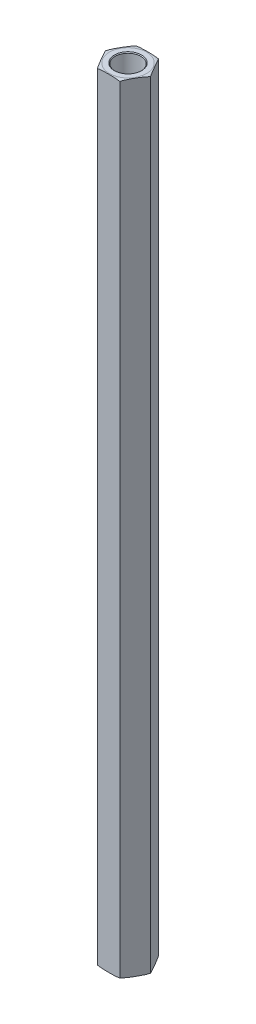
ISO-10303-21;
HEADER;
FILE_DESCRIPTION(('STEP AP214'),'2;1');
FILE_NAME('part.step','',(''),(''),'','','');
FILE_SCHEMA(('AUTOMOTIVE_DESIGN { 1 0 10303 214 1 1 1 1 }'));
ENDSEC;
DATA;
#1=APPLICATION_CONTEXT('core data for automotive mechanical design processes');
#2=APPLICATION_PROTOCOL_DEFINITION('international standard','automotive_design',2000,#1);
#3=PRODUCT_CONTEXT('',#1,'mechanical');
#4=PRODUCT('Part','Part','',(#3));
#5=PRODUCT_RELATED_PRODUCT_CATEGORY('part','',(#4));
#6=PRODUCT_DEFINITION_FORMATION('','',#4);
#7=PRODUCT_DEFINITION_CONTEXT('part definition',#1,'design');
#8=PRODUCT_DEFINITION('design','',#6,#7);
#9=PRODUCT_DEFINITION_SHAPE('','',#8);
#10=(LENGTH_UNIT() NAMED_UNIT(*) SI_UNIT(.MILLI.,.METRE.));
#11=(NAMED_UNIT(*) PLANE_ANGLE_UNIT() SI_UNIT($,.RADIAN.));
#12=(NAMED_UNIT(*) SI_UNIT($,.STERADIAN.) SOLID_ANGLE_UNIT());
#13=UNCERTAINTY_MEASURE_WITH_UNIT(LENGTH_MEASURE(1.E-05),#10,'distance_accuracy_value','');
#14=(GEOMETRIC_REPRESENTATION_CONTEXT(3) GLOBAL_UNCERTAINTY_ASSIGNED_CONTEXT((#13)) GLOBAL_UNIT_ASSIGNED_CONTEXT((#10,
#11,#12)) REPRESENTATION_CONTEXT('',''));
#15=CARTESIAN_POINT('',(0.,0.,0.));
#16=DIRECTION('',(0.,0.,1.));
#17=DIRECTION('',(1.,0.,0.));
#18=AXIS2_PLACEMENT_3D('',#15,#16,#17);
#19=CARTESIAN_POINT('',(0.,50.8,0.));
#20=DIRECTION('',(0.,1.,0.));
#21=DIRECTION('',(0.,0.,1.));
#22=AXIS2_PLACEMENT_3D('',#19,#20,#21);
#23=PLANE('',#22);
#24=CARTESIAN_POINT('',(0.,50.8,0.));
#25=DIRECTION('',(0.,1.,0.));
#26=DIRECTION('',(0.,0.,1.));
#27=AXIS2_PLACEMENT_3D('',#24,#25,#26);
#28=CIRCLE('',#27,2.0955);
#29=CARTESIAN_POINT('',(0.,50.8,2.0955));
#30=VERTEX_POINT('',#29);
#31=EDGE_CURVE('E361',#30,#30,#28,.T.);
#32=ORIENTED_EDGE('',*,*,#31,.T.);
#33=EDGE_LOOP('',(#32));
#34=FACE_BOUND('',#33,.T.);
#35=ADVANCED_FACE('F14',(#34),#23,.T.);
#36=CARTESIAN_POINT('',(0.,-50.8,0.));
#37=DIRECTION('',(0.,-1.,0.));
#38=DIRECTION('',(0.,0.,-1.));
#39=AXIS2_PLACEMENT_3D('',#36,#37,#38);
#40=PLANE('',#39);
#41=CARTESIAN_POINT('',(0.,-50.8,0.));
#42=DIRECTION('',(0.,-1.,0.));
#43=DIRECTION('',(0.,0.,-1.));
#44=AXIS2_PLACEMENT_3D('',#41,#42,#43);
#45=CIRCLE('',#44,2.0955);
#46=CARTESIAN_POINT('',(0.,-50.8,-2.0955));
#47=VERTEX_POINT('',#46);
#48=EDGE_CURVE('E363',#47,#47,#45,.T.);
#49=ORIENTED_EDGE('',*,*,#48,.T.);
#50=EDGE_LOOP('',(#49));
#51=FACE_BOUND('',#50,.T.);
#52=ADVANCED_FACE('F340',(#51),#40,.T.);
#53=CARTESIAN_POINT('',(0.,50.8,0.));
#54=DIRECTION('',(0.,1.,0.));
#55=DIRECTION('',(0.,0.,1.));
#56=AXIS2_PLACEMENT_3D('',#53,#54,#55);
#57=CYLINDRICAL_SURFACE('',#56,2.0955);
#58=CARTESIAN_POINT('',(0.,63.3729999999559,0.));
#59=DIRECTION('',(0.,1.,0.));
#60=DIRECTION('',(0.,0.,1.));
#61=AXIS2_PLACEMENT_3D('',#58,#59,#60);
#62=CIRCLE('',#61,2.09549999993897);
#63=CARTESIAN_POINT('',(0.,63.3729999999559,2.09549999993897));
#64=VERTEX_POINT('',#63);
#65=EDGE_CURVE('E366',#64,#64,#62,.T.);
#66=ORIENTED_EDGE('',*,*,#65,.T.);
#67=EDGE_LOOP('',(#66));
#68=FACE_BOUND('',#67,.T.);
#69=ORIENTED_EDGE('',*,*,#31,.F.);
#70=EDGE_LOOP('',(#69));
#71=FACE_BOUND('',#70,.T.);
#72=ADVANCED_FACE('F332',(#68,#71),#57,.F.);
#73=CARTESIAN_POINT('',(0.,-50.8,0.));
#74=DIRECTION('',(0.,-1.,0.));
#75=DIRECTION('',(0.,0.,-1.));
#76=AXIS2_PLACEMENT_3D('',#73,#74,#75);
#77=CYLINDRICAL_SURFACE('',#76,2.0955);
#78=ORIENTED_EDGE('',*,*,#48,.F.);
#79=EDGE_LOOP('',(#78));
#80=FACE_BOUND('',#79,.T.);
#81=CARTESIAN_POINT('',(0.,-63.3730000000128,0.));
#82=DIRECTION('',(0.,-1.,0.));
#83=DIRECTION('',(0.,0.,-1.));
#84=AXIS2_PLACEMENT_3D('',#81,#82,#83);
#85=CIRCLE('',#84,2.09550000005265);
#86=CARTESIAN_POINT('',(0.,-63.3730000000128,-2.09550000005265));
#87=VERTEX_POINT('',#86);
#88=EDGE_CURVE('E392',#87,#87,#85,.T.);
#89=ORIENTED_EDGE('',*,*,#88,.T.);
#90=EDGE_LOOP('',(#89));
#91=FACE_BOUND('',#90,.T.);
#92=ADVANCED_FACE('F324',(#80,#91),#77,.F.);
#93=CARTESIAN_POINT('',(0.,63.4999999999764,0.));
#94=DIRECTION('',(0.,1.,0.));
#95=DIRECTION('',(0.,0.,1.));
#96=AXIS2_PLACEMENT_3D('',#93,#94,#95);
#97=CONICAL_SURFACE('',#96,2.22249999995938,0.785398163397448);
#98=CARTESIAN_POINT('',(0.,63.5000000000332,0.));
#99=DIRECTION('',(0.,1.,0.));
#100=DIRECTION('',(0.,0.,1.));
#101=AXIS2_PLACEMENT_3D('',#98,#99,#100);
#102=CIRCLE('',#101,2.22250000001623);
#103=CARTESIAN_POINT('',(0.,63.5000000000332,2.22250000001623));
#104=VERTEX_POINT('',#103);
#105=EDGE_CURVE('E379',#104,#104,#102,.T.);
#106=ORIENTED_EDGE('',*,*,#105,.T.);
#107=EDGE_LOOP('',(#106));
#108=FACE_BOUND('',#107,.T.);
#109=ORIENTED_EDGE('',*,*,#65,.F.);
#110=EDGE_LOOP('',(#109));
#111=FACE_BOUND('',#110,.T.);
#112=ADVANCED_FACE('F318',(#108,#111),#97,.F.);
#113=CARTESIAN_POINT('',(3.66617420935412,63.5,0.));
#114=DIRECTION('',(-0.866025403784439,0.,0.5));
#115=DIRECTION('',(0.5,0.,0.866025403784439));
#116=AXIS2_PLACEMENT_3D('',#113,#114,#115);
#117=PLANE('',#116);
#118=DIRECTION('',(0.,1.,0.));
#119=VECTOR('',#118,1.);
#120=CARTESIAN_POINT('',(1.83308710467706,63.5,-3.175));
#121=LINE('',#120,#119);
#122=CARTESIAN_POINT('',(1.83308710467706,-63.373,-3.175));
#123=VERTEX_POINT('',#122);
#124=CARTESIAN_POINT('',(1.83308710467706,63.373,-3.175));
#125=VERTEX_POINT('',#124);
#126=EDGE_CURVE('E77',#123,#125,#121,.T.);
#127=ORIENTED_EDGE('',*,*,#126,.T.);
#128=CARTESIAN_POINT('',(3.66617420935412,63.373,0.));
#129=CARTESIAN_POINT('',(3.62797961467394,63.3889014148997,-0.0661549785605575));
#130=CARTESIAN_POINT('',(3.58956810864157,63.4024886076105,-0.132685658603875));
#131=CARTESIAN_POINT('',(3.51249051795711,63.4258161979402,-0.266187961794358));
#132=CARTESIAN_POINT('',(3.47382473049846,63.4355604771397,-0.333159070187389));
#133=CARTESIAN_POINT('',(3.39641631867873,63.4519966530451,-0.46723437239238));
#134=CARTESIAN_POINT('',(3.35767399633312,63.4586945328669,-0.534338043098183));
#135=CARTESIAN_POINT('',(3.28009834620113,63.4697767572932,-0.66870301055698));
#136=CARTESIAN_POINT('',(3.24126499587771,63.474160450474,-0.735964346345267));
#137=CARTESIAN_POINT('',(3.16354065964315,63.4812403004263,-0.870586845688097));
#138=CARTESIAN_POINT('',(3.12464965374476,63.4839355237591,-0.937948043861568));
#139=CARTESIAN_POINT('',(3.04685144594593,63.4881531983714,-1.07269849250694));
#140=CARTESIAN_POINT('',(3.00794424351969,63.4896756080272,-1.14008774388955));
#141=CARTESIAN_POINT('',(2.93051517598873,63.491922705889,-1.27419882283586));
#142=CARTESIAN_POINT('',(2.89199336248934,63.4926552468181,-1.34092056101649));
#143=CARTESIAN_POINT('',(2.81494778346144,63.4935767302574,-1.47436741839139));
#144=CARTESIAN_POINT('',(2.77642401791439,63.4937656658949,-1.54109253761774));
#145=CARTESIAN_POINT('',(2.69935964431012,63.4936659966806,-1.6745719481538));
#146=CARTESIAN_POINT('',(2.66081903631821,63.4933771811766,-1.74132623935039));
#147=CARTESIAN_POINT('',(2.5837390808533,63.492221986219,-1.87483263846077));
#148=CARTESIAN_POINT('',(2.54519973341245,63.4913555970386,-1.94158474631886));
#149=CARTESIAN_POINT('',(2.46812969629771,63.4887861940656,-2.07507396634282));
#150=CARTESIAN_POINT('',(2.42959900625965,63.4870832271616,-2.14181107913942));
#151=CARTESIAN_POINT('',(2.35255651340908,63.4824387229726,-2.27525259109836));
#152=CARTESIAN_POINT('',(2.31404470975443,63.4794972471358,-2.34195699171935));
#153=CARTESIAN_POINT('',(2.25084206239945,63.4732174124749,-2.45142718811103));
#154=CARTESIAN_POINT('',(2.2261384933701,63.4703980110463,-2.49421502479815));
#155=CARTESIAN_POINT('',(2.17676945272228,63.4638696794304,-2.57972471152111));
#156=CARTESIAN_POINT('',(2.15210397034183,63.4601610809139,-2.62244658019723));
#157=CARTESIAN_POINT('',(2.10282753811696,63.4516802711497,-2.70779586442644));
#158=CARTESIAN_POINT('',(2.07821657107529,63.4469084657008,-2.75042330976602));
#159=CARTESIAN_POINT('',(2.02900094683549,63.4360987712516,-2.83566727147556));
#160=CARTESIAN_POINT('',(2.00439646085463,63.4300577313084,-2.87828349128853));
#161=CARTESIAN_POINT('',(1.95527325900933,63.4165138354161,-2.96336737271505));
#162=CARTESIAN_POINT('',(1.93075459617614,63.409010197803,-3.00583494247579));
#163=CARTESIAN_POINT('',(1.88182157373171,63.3923203507084,-3.09058942351745));
#164=CARTESIAN_POINT('',(1.85740744053269,63.3831314978033,-3.1328759426409));
#165=CARTESIAN_POINT('',(1.83308710467706,63.373,-3.175));
#166=B_SPLINE_CURVE_WITH_KNOTS('',3,(#128,#129,#130,#131,#132,#133,#134,#135,#136,#137,#138,
#139,#140,#141,#142,#143,#144,#145,#146,#147,#148,#149,#150,#151,#152,#153,#154,#155,#156,#157,
#158,#159,#160,#161,#162,#163,#164,#165),.UNSPECIFIED.,.F.,.F.,(4,2,2,2,2,2,2,2,2,2,2,2,2,2,2,2,
2,2,4),(0.,0.233977307817942,0.467717675040691,0.700996973557496,0.934341903229746,
1.16781571967239,1.40129782179824,1.63243665809669,1.86357841666616,2.09482211846293,
2.32606971471494,2.55730435147396,2.78852751694412,2.93698369265086,3.08538458004473,
3.23372892334584,3.38244598546612,3.53124274626084,3.68027493713585),.UNSPECIFIED.);
#167=CARTESIAN_POINT('',(3.66617420935412,63.373,0.));
#168=VERTEX_POINT('',#167);
#169=EDGE_CURVE('E70',#168,#125,#166,.T.);
#170=ORIENTED_EDGE('',*,*,#169,.F.);
#171=DIRECTION('',(0.,1.,0.));
#172=VECTOR('',#171,1.);
#173=CARTESIAN_POINT('',(3.66617420935412,63.5,0.));
#174=LINE('',#173,#172);
#175=CARTESIAN_POINT('',(3.66617420935412,-63.373,0.));
#176=VERTEX_POINT('',#175);
#177=EDGE_CURVE('E74',#168,#176,#174,.F.);
#178=ORIENTED_EDGE('',*,*,#177,.T.);
#179=CARTESIAN_POINT('',(1.83308710467706,-63.373,-3.17499999999999));
#180=CARTESIAN_POINT('',(1.87128169935724,-63.3889014148997,-3.10884502143943));
#181=CARTESIAN_POINT('',(1.90969320538961,-63.4024886076105,-3.04231434139611));
#182=CARTESIAN_POINT('',(1.98677079607407,-63.4258161979402,-2.90881203820563));
#183=CARTESIAN_POINT('',(2.02543658353272,-63.4355604771397,-2.8418409298126));
#184=CARTESIAN_POINT('',(2.10284499535245,-63.4519966530451,-2.70776562760761));
#185=CARTESIAN_POINT('',(2.14158731769806,-63.4586945328669,-2.64066195690181));
#186=CARTESIAN_POINT('',(2.21916296783005,-63.4697767572932,-2.50629698944301));
#187=CARTESIAN_POINT('',(2.25799631815347,-63.474160450474,-2.43903565365472));
#188=CARTESIAN_POINT('',(2.33572065438804,-63.4812403004263,-2.30441315431189));
#189=CARTESIAN_POINT('',(2.37461166028642,-63.4839355237591,-2.23705195613842));
#190=CARTESIAN_POINT('',(2.45240986808525,-63.4881531983714,-2.10230150749304));
#191=CARTESIAN_POINT('',(2.49131707051149,-63.4896756080272,-2.03491225611043));
#192=CARTESIAN_POINT('',(2.56874613804245,-63.491922705889,-1.90080117716413));
#193=CARTESIAN_POINT('',(2.60726795154184,-63.4926552468181,-1.8340794389835));
#194=CARTESIAN_POINT('',(2.68431353056975,-63.4935767302574,-1.70063258160859));
#195=CARTESIAN_POINT('',(2.72283729611679,-63.4937656658949,-1.63390746238224));
#196=CARTESIAN_POINT('',(2.79990166972106,-63.4936659966806,-1.50042805184618));
#197=CARTESIAN_POINT('',(2.83844227771297,-63.4933771811766,-1.4336737606496));
#198=CARTESIAN_POINT('',(2.91552223317789,-63.492221986219,-1.30016736153921));
#199=CARTESIAN_POINT('',(2.95406158061873,-63.4913555970386,-1.23341525368112));
#200=CARTESIAN_POINT('',(3.03113161773348,-63.4887861940656,-1.09992603365716));
#201=CARTESIAN_POINT('',(3.06966230777154,-63.4870832271616,-1.03318892086056));
#202=CARTESIAN_POINT('',(3.1467048006221,-63.4824387229726,-0.899747408901616));
#203=CARTESIAN_POINT('',(3.18521660427676,-63.4794972471358,-0.83304300828063));
#204=CARTESIAN_POINT('',(3.24841925163174,-63.4732174124749,-0.723572811888948));
#205=CARTESIAN_POINT('',(3.27312282066109,-63.4703980110463,-0.680784975201834));
#206=CARTESIAN_POINT('',(3.32249186130891,-63.4638696794304,-0.595275288478877));
#207=CARTESIAN_POINT('',(3.34715734368935,-63.4601610809139,-0.552553419802754));
#208=CARTESIAN_POINT('',(3.39643377591422,-63.4516802711497,-0.467204135573548));
#209=CARTESIAN_POINT('',(3.42104474295589,-63.4469084657008,-0.424576690233975));
#210=CARTESIAN_POINT('',(3.47026036719568,-63.4360987712516,-0.339332728524437));
#211=CARTESIAN_POINT('',(3.49486485317655,-63.4300577313084,-0.296716508711467));
#212=CARTESIAN_POINT('',(3.54398805502185,-63.4165138354161,-0.211632627284948));
#213=CARTESIAN_POINT('',(3.56850671785504,-63.409010197803,-0.169165057524209));
#214=CARTESIAN_POINT('',(3.61743974029946,-63.3923203507084,-0.0844105764825526));
#215=CARTESIAN_POINT('',(3.64185387349848,-63.3831314978033,-0.0421240573591055));
#216=CARTESIAN_POINT('',(3.66617420935411,-63.373,0.));
#217=B_SPLINE_CURVE_WITH_KNOTS('',3,(#179,#180,#181,#182,#183,#184,#185,#186,#187,#188,#189,
#190,#191,#192,#193,#194,#195,#196,#197,#198,#199,#200,#201,#202,#203,#204,#205,#206,#207,#208,
#209,#210,#211,#212,#213,#214,#215,#216),.UNSPECIFIED.,.F.,.F.,(4,2,2,2,2,2,2,2,2,2,2,2,2,2,2,2,
2,2,4),(0.,0.233977307817943,0.467717675040693,0.7009969735575,0.934341903229751,
1.1678157196724,1.40129782179824,1.63243665809669,1.86357841666617,2.09482211846294,
2.32606971471495,2.55730435147398,2.78852751694413,2.93698369265087,3.08538458004473,
3.23372892334584,3.38244598546612,3.53124274626083,3.68027493713583),.UNSPECIFIED.);
#218=EDGE_CURVE('E88',#123,#176,#217,.T.);
#219=ORIENTED_EDGE('',*,*,#218,.F.);
#220=EDGE_LOOP('',(#127,#170,#178,#219));
#221=FACE_BOUND('',#220,.T.);
#222=ADVANCED_FACE('F72',(#221),#117,.F.);
#223=CARTESIAN_POINT('',(0.,-63.4999999999195,0.));
#224=DIRECTION('',(0.,-1.,0.));
#225=DIRECTION('',(0.,0.,-1.));
#226=AXIS2_PLACEMENT_3D('',#223,#224,#225);
#227=CONICAL_SURFACE('',#226,2.22249999995938,0.785398163397448);
#228=ORIENTED_EDGE('',*,*,#88,.F.);
#229=EDGE_LOOP('',(#228));
#230=FACE_BOUND('',#229,.T.);
#231=CARTESIAN_POINT('',(0.,-63.4999999999764,0.));
#232=DIRECTION('',(0.,-1.,0.));
#233=DIRECTION('',(0.,0.,-1.));
#234=AXIS2_PLACEMENT_3D('',#231,#232,#233);
#235=CIRCLE('',#234,2.22250000001623);
#236=CARTESIAN_POINT('',(0.,-63.4999999999764,-2.22250000001623));
#237=VERTEX_POINT('',#236);
#238=EDGE_CURVE('E141',#237,#237,#235,.F.);
#239=ORIENTED_EDGE('',*,*,#238,.F.);
#240=EDGE_LOOP('',(#239));
#241=FACE_BOUND('',#240,.T.);
#242=ADVANCED_FACE('F305',(#230,#241),#227,.F.);
#243=CARTESIAN_POINT('',(-1.83308710467707,63.5,-3.175));
#244=DIRECTION('',(0.,-1.,0.));
#245=DIRECTION('',(0.,0.,-1.));
#246=AXIS2_PLACEMENT_3D('',#243,#244,#245);
#247=PLANE('',#246);
#248=CARTESIAN_POINT('',(0.,63.5,0.));
#249=DIRECTION('',(0.,-1.,0.));
#250=DIRECTION('',(0.,0.,1.));
#251=AXIS2_PLACEMENT_3D('',#248,#249,#250);
#252=CIRCLE('',#251,3.03117420935412);
#253=CARTESIAN_POINT('',(0.,63.5,3.03117420935412));
#254=VERTEX_POINT('',#253);
#255=CARTESIAN_POINT('',(0.,63.5,-3.03117420935412));
#256=VERTEX_POINT('',#255);
#257=EDGE_CURVE('E212',#254,#256,#252,.T.);
#258=ORIENTED_EDGE('',*,*,#257,.F.);
#259=CARTESIAN_POINT('',(0.,63.5,0.));
#260=DIRECTION('',(0.,-1.,0.));
#261=DIRECTION('',(0.,0.,-1.));
#262=AXIS2_PLACEMENT_3D('',#259,#260,#261);
#263=CIRCLE('',#262,3.03117420935412);
#264=EDGE_CURVE('E81',#256,#254,#263,.T.);
#265=ORIENTED_EDGE('',*,*,#264,.F.);
#266=EDGE_LOOP('',(#258,#265));
#267=FACE_BOUND('',#266,.T.);
#268=ORIENTED_EDGE('',*,*,#105,.F.);
#269=EDGE_LOOP('',(#268));
#270=FACE_BOUND('',#269,.T.);
#271=ADVANCED_FACE('F116',(#267,#270),#247,.F.);
#272=CARTESIAN_POINT('',(1.83308710467706,63.5,3.17499999999999));
#273=DIRECTION('',(-0.866025403784439,0.,-0.5));
#274=DIRECTION('',(-0.5,0.,0.866025403784439));
#275=AXIS2_PLACEMENT_3D('',#272,#273,#274);
#276=PLANE('',#275);
#277=ORIENTED_EDGE('',*,*,#177,.F.);
#278=CARTESIAN_POINT('',(1.83308710467706,63.373,3.17499999999999));
#279=CARTESIAN_POINT('',(1.87128169935724,63.3889014148997,3.10884502143944));
#280=CARTESIAN_POINT('',(1.90969320538961,63.4024886076105,3.04231434139612));
#281=CARTESIAN_POINT('',(1.98677079607407,63.4258161979402,2.90881203820563));
#282=CARTESIAN_POINT('',(2.02543658353272,63.4355604771397,2.8418409298126));
#283=CARTESIAN_POINT('',(2.10284499535245,63.4519966530451,2.70776562760761));
#284=CARTESIAN_POINT('',(2.14158731769806,63.4586945328669,2.64066195690181));
#285=CARTESIAN_POINT('',(2.21916296783005,63.4697767572932,2.50629698944301));
#286=CARTESIAN_POINT('',(2.25799631815347,63.474160450474,2.43903565365473));
#287=CARTESIAN_POINT('',(2.33572065438803,63.4812403004263,2.3044131543119));
#288=CARTESIAN_POINT('',(2.37461166028642,63.4839355237591,2.23705195613843));
#289=CARTESIAN_POINT('',(2.45240986808525,63.4881531983714,2.10230150749305));
#290=CARTESIAN_POINT('',(2.49131707051149,63.4896756080272,2.03491225611044));
#291=CARTESIAN_POINT('',(2.56874613804245,63.491922705889,1.90080117716414));
#292=CARTESIAN_POINT('',(2.60726795154183,63.4926552468181,1.83407943898351));
#293=CARTESIAN_POINT('',(2.68431353056974,63.4935767302574,1.70063258160861));
#294=CARTESIAN_POINT('',(2.72283729611679,63.4937656658949,1.63390746238225));
#295=CARTESIAN_POINT('',(2.79990166972105,63.4936659966806,1.50042805184619));
#296=CARTESIAN_POINT('',(2.83844227771297,63.4933771811766,1.43367376064961));
#297=CARTESIAN_POINT('',(2.91552223317788,63.492221986219,1.30016736153923));
#298=CARTESIAN_POINT('',(2.95406158061873,63.4913555970386,1.23341525368113));
#299=CARTESIAN_POINT('',(3.03113161773347,63.4887861940656,1.09992603365718));
#300=CARTESIAN_POINT('',(3.06966230777153,63.4870832271616,1.03318892086057));
#301=CARTESIAN_POINT('',(3.14670480062209,63.4824387229726,0.899747408901633));
#302=CARTESIAN_POINT('',(3.18521660427675,63.4794972471358,0.833043008280648));
#303=CARTESIAN_POINT('',(3.24841925163173,63.4732174124749,0.723572811888964));
#304=CARTESIAN_POINT('',(3.27312282066108,63.4703980110463,0.680784975201849));
#305=CARTESIAN_POINT('',(3.3224918613089,63.4638696794304,0.59527528847889));
#306=CARTESIAN_POINT('',(3.34715734368934,63.4601610809139,0.552553419802766));
#307=CARTESIAN_POINT('',(3.39643377591422,63.4516802711497,0.467204135573558));
#308=CARTESIAN_POINT('',(3.42104474295589,63.4469084657008,0.424576690233984));
#309=CARTESIAN_POINT('',(3.47026036719568,63.4360987712516,0.339332728524444));
#310=CARTESIAN_POINT('',(3.49486485317655,63.4300577313084,0.296716508711472));
#311=CARTESIAN_POINT('',(3.54398805502185,63.4165138354161,0.211632627284952));
#312=CARTESIAN_POINT('',(3.56850671785504,63.409010197803,0.169165057524211));
#313=CARTESIAN_POINT('',(3.61743974029947,63.3923203507084,0.0844105764825531));
#314=CARTESIAN_POINT('',(3.64185387349848,63.3831314978033,0.0421240573591049));
#315=CARTESIAN_POINT('',(3.66617420935412,63.373,0.));
#316=B_SPLINE_CURVE_WITH_KNOTS('',3,(#278,#279,#280,#281,#282,#283,#284,#285,#286,#287,#288,
#289,#290,#291,#292,#293,#294,#295,#296,#297,#298,#299,#300,#301,#302,#303,#304,#305,#306,#307,
#308,#309,#310,#311,#312,#313,#314,#315),.UNSPECIFIED.,.F.,.F.,(4,2,2,2,2,2,2,2,2,2,2,2,2,2,2,2,
2,2,4),(0.,0.233977307817942,0.467717675040691,0.700996973557495,0.934341903229744,
1.16781571967239,1.40129782179823,1.63243665809668,1.86357841666616,2.09482211846293,
2.32606971471493,2.55730435147396,2.78852751694411,2.93698369265086,3.08538458004472,
3.23372892334583,3.38244598546611,3.53124274626083,3.68027493713584),.UNSPECIFIED.);
#317=CARTESIAN_POINT('',(1.83308710467706,63.373,3.17499999999999));
#318=VERTEX_POINT('',#317);
#319=EDGE_CURVE('E80',#318,#168,#316,.T.);
#320=ORIENTED_EDGE('',*,*,#319,.F.);
#321=DIRECTION('',(0.,1.,0.));
#322=VECTOR('',#321,1.);
#323=CARTESIAN_POINT('',(1.83308710467706,63.5,3.17499999999999));
#324=LINE('',#323,#322);
#325=CARTESIAN_POINT('',(1.83308710467706,-63.373,3.17499999999999));
#326=VERTEX_POINT('',#325);
#327=EDGE_CURVE('E172',#318,#326,#324,.F.);
#328=ORIENTED_EDGE('',*,*,#327,.T.);
#329=CARTESIAN_POINT('',(3.66617420935412,-63.373,0.));
#330=CARTESIAN_POINT('',(3.62797961467394,-63.3889014148997,0.0661549785605647));
#331=CARTESIAN_POINT('',(3.58956810864156,-63.4024886076105,0.132685658603882));
#332=CARTESIAN_POINT('',(3.5124905179571,-63.4258161979402,0.266187961794366));
#333=CARTESIAN_POINT('',(3.47382473049846,-63.4355604771397,0.333159070187398));
#334=CARTESIAN_POINT('',(3.39641631867873,-63.4519966530451,0.467234372392389));
#335=CARTESIAN_POINT('',(3.35767399633312,-63.4586945328669,0.534338043098192));
#336=CARTESIAN_POINT('',(3.28009834620113,-63.4697767572932,0.668703010556991));
#337=CARTESIAN_POINT('',(3.24126499587771,-63.474160450474,0.735964346345278));
#338=CARTESIAN_POINT('',(3.16354065964314,-63.4812403004263,0.870586845688109));
#339=CARTESIAN_POINT('',(3.12464965374475,-63.4839355237591,0.93794804386158));
#340=CARTESIAN_POINT('',(3.04685144594592,-63.4881531983714,1.07269849250696));
#341=CARTESIAN_POINT('',(3.00794424351969,-63.4896756080272,1.14008774388956));
#342=CARTESIAN_POINT('',(2.93051517598873,-63.491922705889,1.27419882283587));
#343=CARTESIAN_POINT('',(2.89199336248934,-63.4926552468181,1.3409205610165));
#344=CARTESIAN_POINT('',(2.81494778346143,-63.4935767302574,1.4743674183914));
#345=CARTESIAN_POINT('',(2.77642401791439,-63.4937656658949,1.54109253761776));
#346=CARTESIAN_POINT('',(2.69935964431012,-63.4936659966806,1.67457194815382));
#347=CARTESIAN_POINT('',(2.66081903631821,-63.4933771811766,1.7413262393504));
#348=CARTESIAN_POINT('',(2.58373908085329,-63.492221986219,1.87483263846078));
#349=CARTESIAN_POINT('',(2.54519973341244,-63.4913555970386,1.94158474631888));
#350=CARTESIAN_POINT('',(2.4681296962977,-63.4887861940656,2.07507396634284));
#351=CARTESIAN_POINT('',(2.42959900625964,-63.4870832271616,2.14181107913944));
#352=CARTESIAN_POINT('',(2.35255651340908,-63.4824387229726,2.27525259109838));
#353=CARTESIAN_POINT('',(2.31404470975442,-63.4794972471358,2.34195699171937));
#354=CARTESIAN_POINT('',(2.25084206239944,-63.4732174124749,2.45142718811105));
#355=CARTESIAN_POINT('',(2.22613849337009,-63.4703980110463,2.49421502479816));
#356=CARTESIAN_POINT('',(2.17676945272227,-63.4638696794304,2.57972471152112));
#357=CARTESIAN_POINT('',(2.15210397034183,-63.4601610809139,2.62244658019724));
#358=CARTESIAN_POINT('',(2.10282753811696,-63.4516802711497,2.70779586442645));
#359=CARTESIAN_POINT('',(2.07821657107529,-63.4469084657008,2.75042330976602));
#360=CARTESIAN_POINT('',(2.0290009468355,-63.4360987712516,2.83566727147556));
#361=CARTESIAN_POINT('',(2.00439646085463,-63.4300577313084,2.87828349128853));
#362=CARTESIAN_POINT('',(1.95527325900933,-63.4165138354161,2.96336737271505));
#363=CARTESIAN_POINT('',(1.93075459617614,-63.409010197803,3.00583494247579));
#364=CARTESIAN_POINT('',(1.88182157373172,-63.3923203507084,3.09058942351744));
#365=CARTESIAN_POINT('',(1.8574074405327,-63.3831314978033,3.13287594264089));
#366=CARTESIAN_POINT('',(1.83308710467707,-63.373,3.17499999999999));
#367=B_SPLINE_CURVE_WITH_KNOTS('',3,(#329,#330,#331,#332,#333,#334,#335,#336,#337,#338,#339,
#340,#341,#342,#343,#344,#345,#346,#347,#348,#349,#350,#351,#352,#353,#354,#355,#356,#357,#358,
#359,#360,#361,#362,#363,#364,#365,#366),.UNSPECIFIED.,.F.,.F.,(4,2,2,2,2,2,2,2,2,2,2,2,2,2,2,2,
2,2,4),(0.,0.233977307817943,0.467717675040694,0.7009969735575,0.934341903229751,
1.1678157196724,1.40129782179824,1.6324366580967,1.86357841666617,2.09482211846294,
2.32606971471495,2.55730435147398,2.78852751694413,2.93698369265087,3.08538458004473,
3.23372892334584,3.38244598546611,3.53124274626083,3.68027493713583),.UNSPECIFIED.);
#368=EDGE_CURVE('E87',#176,#326,#367,.T.);
#369=ORIENTED_EDGE('',*,*,#368,.F.);
#370=EDGE_LOOP('',(#277,#320,#328,#369));
#371=FACE_BOUND('',#370,.T.);
#372=ADVANCED_FACE('F84',(#371),#276,.F.);
#373=CARTESIAN_POINT('',(1.83308710467706,63.5,-3.175));
#374=DIRECTION('',(0.,0.,1.));
#375=DIRECTION('',(1.,0.,0.));
#376=AXIS2_PLACEMENT_3D('',#373,#374,#375);
#377=PLANE('',#376);
#378=DIRECTION('',(0.,1.,0.));
#379=VECTOR('',#378,1.);
#380=CARTESIAN_POINT('',(-1.83308710467708,63.5,-3.17499999999998));
#381=LINE('',#380,#379);
#382=CARTESIAN_POINT('',(-1.83308710467708,-63.373,-3.17499999999998));
#383=VERTEX_POINT('',#382);
#384=CARTESIAN_POINT('',(-1.83308710467706,63.373,-3.17500000000001));
#385=VERTEX_POINT('',#384);
#386=EDGE_CURVE('E152',#383,#385,#381,.T.);
#387=ORIENTED_EDGE('',*,*,#386,.T.);
#388=CARTESIAN_POINT('',(1.83308710467706,63.373,-3.17500000000001));
#389=CARTESIAN_POINT('',(1.73237579828683,63.3939400141518,-3.175));
#390=CARTESIAN_POINT('',(1.63096506893486,63.4108853495327,-3.175));
#391=CARTESIAN_POINT('',(1.42767146651469,63.4384971643984,-3.175));
#392=CARTESIAN_POINT('',(1.32579191427254,63.4491875658753,-3.175));
#393=CARTESIAN_POINT('',(1.12177634709138,63.4661280408079,-3.175));
#394=CARTESIAN_POINT('',(1.0196405664338,63.4723812707189,-3.175));
#395=CARTESIAN_POINT('',(0.815663681397375,63.4819028064183,-3.175));
#396=CARTESIAN_POINT('',(0.713823115514573,63.4851834044999,-3.175));
#397=CARTESIAN_POINT('',(0.510018485441651,63.4899454848703,-3.175));
#398=CARTESIAN_POINT('',(0.408054390577976,63.4914254100882,-3.175));
#399=CARTESIAN_POINT('',(0.20406020033787,63.4933146818379,-3.175));
#400=CARTESIAN_POINT('',(0.102030100168935,63.4937234241492,-3.175));
#401=CARTESIAN_POINT('',(-0.102030100168934,63.4937234241492,-3.175));
#402=CARTESIAN_POINT('',(-0.204060200337869,63.4933146818379,-3.175));
#403=CARTESIAN_POINT('',(-0.408054390577975,63.4914254100882,-3.175));
#404=CARTESIAN_POINT('',(-0.510018485441649,63.4899454848703,-3.175));
#405=CARTESIAN_POINT('',(-0.713823115514571,63.4851834044999,-3.175));
#406=CARTESIAN_POINT('',(-0.815663681397373,63.4819028064183,-3.175));
#407=CARTESIAN_POINT('',(-1.01964056643379,63.4723812707189,-3.175));
#408=CARTESIAN_POINT('',(-1.12177634709137,63.4661280408079,-3.175));
#409=CARTESIAN_POINT('',(-1.32579191427254,63.4491875658753,-3.175));
#410=CARTESIAN_POINT('',(-1.42767146651469,63.4384971643984,-3.175));
#411=CARTESIAN_POINT('',(-1.63096506893485,63.4108853495327,-3.175));
#412=CARTESIAN_POINT('',(-1.73237579828683,63.3939400141518,-3.175));
#413=CARTESIAN_POINT('',(-1.83308710467705,63.373,-3.175));
#414=B_SPLINE_CURVE_WITH_KNOTS('',3,(#388,#389,#390,#391,#392,#393,#394,#395,#396,#397,#398,
#399,#400,#401,#402,#403,#404,#405,#406,#407,#408,#409,#410,#411,#412,#413),.UNSPECIFIED.,.F.,
.F.,(4,2,2,2,2,2,2,2,2,2,2,2,4),(0.,0.308333242342807,0.615479423308233,0.922406891130008,
1.2280592962085,1.53397581645216,1.84006485747889,2.14615389850561,2.45207041874927,
2.75772282382776,3.06465029164954,3.37179647261496,3.68012971495777),.UNSPECIFIED.);
#415=EDGE_CURVE('E145',#125,#385,#414,.T.);
#416=ORIENTED_EDGE('',*,*,#415,.F.);
#417=ORIENTED_EDGE('',*,*,#126,.F.);
#418=CARTESIAN_POINT('',(-1.83308710467707,-63.373,-3.175));
#419=CARTESIAN_POINT('',(-1.73237579828684,-63.3939400141518,-3.175));
#420=CARTESIAN_POINT('',(-1.63096506893487,-63.4108853495327,-3.175));
#421=CARTESIAN_POINT('',(-1.4276714665147,-63.4384971643984,-3.175));
#422=CARTESIAN_POINT('',(-1.32579191427255,-63.4491875658753,-3.175));
#423=CARTESIAN_POINT('',(-1.12177634709138,-63.4661280408079,-3.175));
#424=CARTESIAN_POINT('',(-1.0196405664338,-63.4723812707189,-3.175));
#425=CARTESIAN_POINT('',(-0.81566368139738,-63.4819028064183,-3.175));
#426=CARTESIAN_POINT('',(-0.713823115514577,-63.4851834044999,-3.175));
#427=CARTESIAN_POINT('',(-0.510018485441654,-63.4899454848703,-3.175));
#428=CARTESIAN_POINT('',(-0.408054390577979,-63.4914254100882,-3.175));
#429=CARTESIAN_POINT('',(-0.204060200337872,-63.4933146818379,-3.175));
#430=CARTESIAN_POINT('',(-0.102030100168936,-63.4937234241492,-3.175));
#431=CARTESIAN_POINT('',(0.102030100168935,-63.4937234241492,-3.175));
#432=CARTESIAN_POINT('',(0.20406020033787,-63.4933146818379,-3.175));
#433=CARTESIAN_POINT('',(0.408054390577976,-63.4914254100882,-3.175));
#434=CARTESIAN_POINT('',(0.510018485441651,-63.4899454848703,-3.175));
#435=CARTESIAN_POINT('',(0.713823115514573,-63.4851834044999,-3.175));
#436=CARTESIAN_POINT('',(0.815663681397375,-63.4819028064183,-3.175));
#437=CARTESIAN_POINT('',(1.0196405664338,-63.4723812707189,-3.175));
#438=CARTESIAN_POINT('',(1.12177634709137,-63.4661280408079,-3.175));
#439=CARTESIAN_POINT('',(1.32579191427254,-63.4491875658753,-3.175));
#440=CARTESIAN_POINT('',(1.42767146651469,-63.4384971643984,-3.175));
#441=CARTESIAN_POINT('',(1.63096506893486,-63.4108853495327,-3.175));
#442=CARTESIAN_POINT('',(1.73237579828683,-63.3939400141518,-3.175));
#443=CARTESIAN_POINT('',(1.83308710467706,-63.373,-3.17500000000001));
#444=B_SPLINE_CURVE_WITH_KNOTS('',3,(#418,#419,#420,#421,#422,#423,#424,#425,#426,#427,#428,
#429,#430,#431,#432,#433,#434,#435,#436,#437,#438,#439,#440,#441,#442,#443),.UNSPECIFIED.,.F.,
.F.,(4,2,2,2,2,2,2,2,2,2,2,2,4),(0.,0.308333242342808,0.615479423308236,0.922406891130012,
1.22805929620851,1.53397581645217,1.8400648574789,2.14615389850562,2.45207041874928,
2.75772282382777,3.06465029164955,3.37179647261498,3.68012971495778),.UNSPECIFIED.);
#445=EDGE_CURVE('E174',#383,#123,#444,.T.);
#446=ORIENTED_EDGE('',*,*,#445,.F.);
#447=EDGE_LOOP('',(#387,#416,#417,#446));
#448=FACE_BOUND('',#447,.T.);
#449=ADVANCED_FACE('F133',(#448),#377,.F.);
#450=CARTESIAN_POINT('',(-1.83308710467707,-63.5,-3.175));
#451=DIRECTION('',(0.,-1.,0.));
#452=DIRECTION('',(0.,0.,-1.));
#453=AXIS2_PLACEMENT_3D('',#450,#451,#452);
#454=PLANE('',#453);
#455=CARTESIAN_POINT('',(0.,-63.5,0.));
#456=DIRECTION('',(0.,1.,0.));
#457=DIRECTION('',(0.,0.,1.));
#458=AXIS2_PLACEMENT_3D('',#455,#456,#457);
#459=CIRCLE('',#458,3.03117420935412);
#460=CARTESIAN_POINT('',(0.,-63.5,-3.03117420935412));
#461=VERTEX_POINT('',#460);
#462=CARTESIAN_POINT('',(0.,-63.5,3.03117420935412));
#463=VERTEX_POINT('',#462);
#464=EDGE_CURVE('E144',#461,#463,#459,.F.);
#465=ORIENTED_EDGE('',*,*,#464,.T.);
#466=CARTESIAN_POINT('',(0.,-63.5,0.));
#467=DIRECTION('',(0.,1.,0.));
#468=DIRECTION('',(0.,0.,-1.));
#469=AXIS2_PLACEMENT_3D('',#466,#467,#468);
#470=CIRCLE('',#469,3.03117420935412);
#471=EDGE_CURVE('E208',#461,#463,#470,.T.);
#472=ORIENTED_EDGE('',*,*,#471,.F.);
#473=EDGE_LOOP('',(#465,#472));
#474=FACE_BOUND('',#473,.T.);
#475=ORIENTED_EDGE('',*,*,#238,.T.);
#476=EDGE_LOOP('',(#475));
#477=FACE_BOUND('',#476,.T.);
#478=ADVANCED_FACE('F239',(#474,#477),#454,.T.);
#479=CARTESIAN_POINT('',(-1.83308710467707,63.5,-3.175));
#480=DIRECTION('',(0.866025403784439,0.,0.5));
#481=DIRECTION('',(0.5,0.,-0.866025403784439));
#482=AXIS2_PLACEMENT_3D('',#479,#480,#481);
#483=PLANE('',#482);
#484=DIRECTION('',(0.,1.,0.));
#485=VECTOR('',#484,1.);
#486=CARTESIAN_POINT('',(-3.66617420935413,63.5,0.));
#487=LINE('',#486,#485);
#488=CARTESIAN_POINT('',(-3.66617420935412,-63.373,0.));
#489=VERTEX_POINT('',#488);
#490=CARTESIAN_POINT('',(-3.66617420935412,63.373,0.));
#491=VERTEX_POINT('',#490);
#492=EDGE_CURVE('E226',#489,#491,#487,.T.);
#493=ORIENTED_EDGE('',*,*,#492,.T.);
#494=CARTESIAN_POINT('',(-1.83308710467706,63.373,-3.17500000000001));
#495=CARTESIAN_POINT('',(-1.87128169935723,63.3889014148997,-3.10884502143946));
#496=CARTESIAN_POINT('',(-1.90969320538961,63.4024886076105,-3.04231434139614));
#497=CARTESIAN_POINT('',(-1.98677079607407,63.4258161979402,-2.90881203820566));
#498=CARTESIAN_POINT('',(-2.02543658353271,63.4355604771397,-2.84184092981263));
#499=CARTESIAN_POINT('',(-2.10284499535244,63.4519966530451,-2.70776562760765));
#500=CARTESIAN_POINT('',(-2.14158731769805,63.4586945328669,-2.64066195690185));
#501=CARTESIAN_POINT('',(-2.21916296783004,63.4697767572932,-2.50629698944305));
#502=CARTESIAN_POINT('',(-2.25799631815346,63.474160450474,-2.43903565365477));
#503=CARTESIAN_POINT('',(-2.33572065438802,63.4812403004263,-2.30441315431194));
#504=CARTESIAN_POINT('',(-2.3746116602864,63.4839355237591,-2.23705195613847));
#505=CARTESIAN_POINT('',(-2.45240986808523,63.4881531983714,-2.1023015074931));
#506=CARTESIAN_POINT('',(-2.49131707051147,63.4896756080272,-2.03491225611049));
#507=CARTESIAN_POINT('',(-2.56874613804243,63.491922705889,-1.90080117716419));
#508=CARTESIAN_POINT('',(-2.60726795154181,63.4926552468181,-1.83407943898356));
#509=CARTESIAN_POINT('',(-2.68431353056972,63.4935767302574,-1.70063258160866));
#510=CARTESIAN_POINT('',(-2.72283729611676,63.4937656658949,-1.63390746238232));
#511=CARTESIAN_POINT('',(-2.79990166972103,63.4936659966806,-1.50042805184626));
#512=CARTESIAN_POINT('',(-2.83844227771294,63.4933771811766,-1.43367376064968));
#513=CARTESIAN_POINT('',(-2.91552223317785,63.492221986219,-1.3001673615393));
#514=CARTESIAN_POINT('',(-2.95406158061869,63.4913555970386,-1.23341525368121));
#515=CARTESIAN_POINT('',(-3.03113161773344,63.4887861940656,-1.09992603365725));
#516=CARTESIAN_POINT('',(-3.06966230777149,63.4870832271616,-1.03318892086065));
#517=CARTESIAN_POINT('',(-3.14670480062206,63.4824387229726,-0.899747408901715));
#518=CARTESIAN_POINT('',(-3.18521660427671,63.4794972471358,-0.833043008280732));
#519=CARTESIAN_POINT('',(-3.24841925163169,63.4732174124749,-0.723572811889045));
#520=CARTESIAN_POINT('',(-3.27312282066104,63.4703980110463,-0.680784975201925));
#521=CARTESIAN_POINT('',(-3.32249186130887,63.4638696794304,-0.595275288478956));
#522=CARTESIAN_POINT('',(-3.34715734368932,63.4601610809139,-0.552553419802827));
#523=CARTESIAN_POINT('',(-3.3964337759142,63.4516802711497,-0.467204135573608));
#524=CARTESIAN_POINT('',(-3.42104474295587,63.4469084657009,-0.424576690234028));
#525=CARTESIAN_POINT('',(-3.47026036719567,63.4360987712516,-0.339332728524478));
#526=CARTESIAN_POINT('',(-3.49486485317654,63.4300577313084,-0.296716508711503));
#527=CARTESIAN_POINT('',(-3.54398805502184,63.4165138354161,-0.211632627284972));
#528=CARTESIAN_POINT('',(-3.56850671785504,63.409010197803,-0.169165057524226));
#529=CARTESIAN_POINT('',(-3.61743974029947,63.3923203507084,-0.0844105764825573));
#530=CARTESIAN_POINT('',(-3.64185387349849,63.3831314978033,-0.0421240573591043));
#531=CARTESIAN_POINT('',(-3.66617420935413,63.373,0.));
#532=B_SPLINE_CURVE_WITH_KNOTS('',3,(#494,#495,#496,#497,#498,#499,#500,#501,#502,#503,#504,
#505,#506,#507,#508,#509,#510,#511,#512,#513,#514,#515,#516,#517,#518,#519,#520,#521,#522,#523,
#524,#525,#526,#527,#528,#529,#530,#531),.UNSPECIFIED.,.F.,.F.,(4,2,2,2,2,2,2,2,2,2,2,2,2,2,2,2,
2,2,4),(0.,0.233977307817935,0.467717675040677,0.700996973557475,0.934341903229717,
1.16781571967236,1.4012978217982,1.63243665809664,1.8635784166661,2.09482211846287,
2.32606971471487,2.55730435147389,2.78852751694403,2.9369836926508,3.08538458004468,
3.23372892334581,3.38244598546611,3.53124274626084,3.68027493713587),.UNSPECIFIED.);
#533=EDGE_CURVE('E151',#385,#491,#532,.T.);
#534=ORIENTED_EDGE('',*,*,#533,.F.);
#535=ORIENTED_EDGE('',*,*,#386,.F.);
#536=CARTESIAN_POINT('',(-3.66617420935412,-63.373,0.));
#537=CARTESIAN_POINT('',(-3.62797961467395,-63.3889014148997,-0.0661549785605691));
#538=CARTESIAN_POINT('',(-3.58956810864157,-63.4024886076105,-0.132685658603886));
#539=CARTESIAN_POINT('',(-3.51249051795711,-63.4258161979402,-0.266187961794369));
#540=CARTESIAN_POINT('',(-3.47382473049847,-63.4355604771397,-0.3331590701874));
#541=CARTESIAN_POINT('',(-3.39641631867874,-63.4519966530451,-0.46723437239239));
#542=CARTESIAN_POINT('',(-3.35767399633313,-63.4586945328669,-0.534338043098193));
#543=CARTESIAN_POINT('',(-3.28009834620114,-63.4697767572932,-0.66870301055699));
#544=CARTESIAN_POINT('',(-3.24126499587772,-63.474160450474,-0.735964346345277));
#545=CARTESIAN_POINT('',(-3.16354065964315,-63.4812403004263,-0.870586845688106));
#546=CARTESIAN_POINT('',(-3.12464965374476,-63.4839355237591,-0.937948043861577));
#547=CARTESIAN_POINT('',(-3.04685144594593,-63.4881531983714,-1.07269849250695));
#548=CARTESIAN_POINT('',(-3.0079442435197,-63.4896756080272,-1.14008774388956));
#549=CARTESIAN_POINT('',(-2.93051517598874,-63.491922705889,-1.27419882283587));
#550=CARTESIAN_POINT('',(-2.89199336248935,-63.4926552468181,-1.3409205610165));
#551=CARTESIAN_POINT('',(-2.81494778346144,-63.4935767302574,-1.4743674183914));
#552=CARTESIAN_POINT('',(-2.7764240179144,-63.4937656658949,-1.54109253761775));
#553=CARTESIAN_POINT('',(-2.69935964431013,-63.4936659966806,-1.67457194815381));
#554=CARTESIAN_POINT('',(-2.66081903631822,-63.4933771811766,-1.7413262393504));
#555=CARTESIAN_POINT('',(-2.5837390808533,-63.492221986219,-1.87483263846078));
#556=CARTESIAN_POINT('',(-2.54519973341246,-63.4913555970386,-1.94158474631887));
#557=CARTESIAN_POINT('',(-2.46812969629771,-63.4887861940656,-2.07507396634283));
#558=CARTESIAN_POINT('',(-2.42959900625966,-63.4870832271616,-2.14181107913943));
#559=CARTESIAN_POINT('',(-2.35255651340909,-63.4824387229726,-2.27525259109837));
#560=CARTESIAN_POINT('',(-2.31404470975443,-63.4794972471358,-2.34195699171936));
#561=CARTESIAN_POINT('',(-2.25084206239946,-63.4732174124749,-2.45142718811104));
#562=CARTESIAN_POINT('',(-2.22613849337011,-63.4703980110463,-2.49421502479815));
#563=CARTESIAN_POINT('',(-2.17676945272229,-63.4638696794304,-2.57972471152111));
#564=CARTESIAN_POINT('',(-2.15210397034184,-63.4601610809139,-2.62244658019723));
#565=CARTESIAN_POINT('',(-2.10282753811697,-63.4516802711497,-2.70779586442644));
#566=CARTESIAN_POINT('',(-2.0782165710753,-63.4469084657008,-2.75042330976601));
#567=CARTESIAN_POINT('',(-2.02900094683551,-63.4360987712516,-2.83566727147555));
#568=CARTESIAN_POINT('',(-2.00439646085465,-63.4300577313084,-2.87828349128852));
#569=CARTESIAN_POINT('',(-1.95527325900935,-63.4165138354161,-2.96336737271504));
#570=CARTESIAN_POINT('',(-1.93075459617616,-63.409010197803,-3.00583494247578));
#571=CARTESIAN_POINT('',(-1.88182157373173,-63.3923203507084,-3.09058942351743));
#572=CARTESIAN_POINT('',(-1.85740744053272,-63.3831314978033,-3.13287594264088));
#573=CARTESIAN_POINT('',(-1.83308710467708,-63.373,-3.17499999999998));
#574=B_SPLINE_CURVE_WITH_KNOTS('',3,(#536,#537,#538,#539,#540,#541,#542,#543,#544,#545,#546,
#547,#548,#549,#550,#551,#552,#553,#554,#555,#556,#557,#558,#559,#560,#561,#562,#563,#564,#565,
#566,#567,#568,#569,#570,#571,#572,#573),.UNSPECIFIED.,.F.,.F.,(4,2,2,2,2,2,2,2,2,2,2,2,2,2,2,2,
2,2,4),(0.,0.233977307817941,0.46771767504069,0.700996973557493,0.934341903229743,
1.16781571967239,1.40129782179824,1.63243665809669,1.86357841666616,2.09482211846293,
2.32606971471493,2.55730435147396,2.78852751694411,2.93698369265085,3.08538458004471,
3.23372892334582,3.3824459854661,3.53124274626081,3.68027493713581),.UNSPECIFIED.);
#575=EDGE_CURVE('E201',#489,#383,#574,.T.);
#576=ORIENTED_EDGE('',*,*,#575,.F.);
#577=EDGE_LOOP('',(#493,#534,#535,#576));
#578=FACE_BOUND('',#577,.T.);
#579=ADVANCED_FACE('F162',(#578),#483,.F.);
#580=CARTESIAN_POINT('',(0.,61.849,0.));
#581=DIRECTION('',(0.,1.,0.));
#582=DIRECTION('',(0.,0.,1.));
#583=AXIS2_PLACEMENT_3D('',#580,#581,#582);
#584=TOROIDAL_SURFACE('',#583,3.03117420935412,1.65099999999997);
#585=ORIENTED_EDGE('',*,*,#169,.T.);
#586=ORIENTED_EDGE('',*,*,#415,.T.);
#587=ORIENTED_EDGE('',*,*,#533,.T.);
#588=CARTESIAN_POINT('',(-3.66617420935412,63.373,0.));
#589=CARTESIAN_POINT('',(-3.62797961467395,63.3889014148997,0.066154978560565));
#590=CARTESIAN_POINT('',(-3.58956810864157,63.4024886076105,0.132685658603882));
#591=CARTESIAN_POINT('',(-3.51249051795711,63.4258161979402,0.266187961794366));
#592=CARTESIAN_POINT('',(-3.47382473049846,63.4355604771397,0.333159070187397));
#593=CARTESIAN_POINT('',(-3.39641631867873,63.4519966530451,0.467234372392388));
#594=CARTESIAN_POINT('',(-3.35767399633313,63.4586945328669,0.534338043098191));
#595=CARTESIAN_POINT('',(-3.28009834620113,63.4697767572932,0.668703010556989));
#596=CARTESIAN_POINT('',(-3.24126499587771,63.474160450474,0.735964346345277));
#597=CARTESIAN_POINT('',(-3.16354065964315,63.4812403004263,0.870586845688107));
#598=CARTESIAN_POINT('',(-3.12464965374476,63.4839355237591,0.937948043861578));
#599=CARTESIAN_POINT('',(-3.04685144594593,63.4881531983714,1.07269849250696));
#600=CARTESIAN_POINT('',(-3.00794424351969,63.4896756080272,1.14008774388956));
#601=CARTESIAN_POINT('',(-2.93051517598873,63.491922705889,1.27419882283587));
#602=CARTESIAN_POINT('',(-2.89199336248934,63.4926552468181,1.3409205610165));
#603=CARTESIAN_POINT('',(-2.81494778346143,63.4935767302574,1.4743674183914));
#604=CARTESIAN_POINT('',(-2.77642401791439,63.4937656658949,1.54109253761776));
#605=CARTESIAN_POINT('',(-2.69935964431012,63.4936659966806,1.67457194815382));
#606=CARTESIAN_POINT('',(-2.66081903631821,63.4933771811766,1.7413262393504));
#607=CARTESIAN_POINT('',(-2.5837390808533,63.492221986219,1.87483263846078));
#608=CARTESIAN_POINT('',(-2.54519973341245,63.4913555970386,1.94158474631888));
#609=CARTESIAN_POINT('',(-2.46812969629771,63.4887861940656,2.07507396634284));
#610=CARTESIAN_POINT('',(-2.42959900625965,63.4870832271616,2.14181107913944));
#611=CARTESIAN_POINT('',(-2.35255651340908,63.4824387229726,2.27525259109838));
#612=CARTESIAN_POINT('',(-2.31404470975442,63.4794972471358,2.34195699171937));
#613=CARTESIAN_POINT('',(-2.25084206239945,63.4732174124749,2.45142718811105));
#614=CARTESIAN_POINT('',(-2.2261384933701,63.4703980110463,2.49421502479816));
#615=CARTESIAN_POINT('',(-2.17676945272228,63.4638696794304,2.57972471152112));
#616=CARTESIAN_POINT('',(-2.15210397034183,63.4601610809139,2.62244658019725));
#617=CARTESIAN_POINT('',(-2.10282753811696,63.4516802711497,2.70779586442645));
#618=CARTESIAN_POINT('',(-2.07821657107529,63.4469084657008,2.75042330976603));
#619=CARTESIAN_POINT('',(-2.0290009468355,63.4360987712516,2.83566727147557));
#620=CARTESIAN_POINT('',(-2.00439646085464,63.4300577313084,2.87828349128854));
#621=CARTESIAN_POINT('',(-1.95527325900934,63.4165138354161,2.96336737271506));
#622=CARTESIAN_POINT('',(-1.93075459617614,63.409010197803,3.0058349424758));
#623=CARTESIAN_POINT('',(-1.88182157373172,63.3923203507084,3.09058942351745));
#624=CARTESIAN_POINT('',(-1.8574074405327,63.3831314978033,3.1328759426409));
#625=CARTESIAN_POINT('',(-1.83308710467707,63.373,3.175));
#626=B_SPLINE_CURVE_WITH_KNOTS('',3,(#588,#589,#590,#591,#592,#593,#594,#595,#596,#597,#598,
#599,#600,#601,#602,#603,#604,#605,#606,#607,#608,#609,#610,#611,#612,#613,#614,#615,#616,#617,
#618,#619,#620,#621,#622,#623,#624,#625),.UNSPECIFIED.,.F.,.F.,(4,2,2,2,2,2,2,2,2,2,2,2,2,2,2,2,
2,2,4),(0.,0.233977307817942,0.467717675040692,0.700996973557497,0.934341903229748,
1.16781571967239,1.40129782179824,1.63243665809669,1.86357841666617,2.09482211846294,
2.32606971471495,2.55730435147398,2.78852751694413,2.93698369265087,3.08538458004473,
3.23372892334584,3.38244598546612,3.53124274626083,3.68027493713584),.UNSPECIFIED.);
#627=CARTESIAN_POINT('',(-1.83308710467706,63.373,3.175));
#628=VERTEX_POINT('',#627);
#629=EDGE_CURVE('E218',#491,#628,#626,.T.);
#630=ORIENTED_EDGE('',*,*,#629,.T.);
#631=CARTESIAN_POINT('',(-1.83308710467706,63.373,3.175));
#632=CARTESIAN_POINT('',(-1.73237579828684,63.3939400141518,3.175));
#633=CARTESIAN_POINT('',(-1.63096506893486,63.4108853495327,3.175));
#634=CARTESIAN_POINT('',(-1.42767146651469,63.4384971643984,3.175));
#635=CARTESIAN_POINT('',(-1.32579191427254,63.4491875658753,3.175));
#636=CARTESIAN_POINT('',(-1.12177634709138,63.4661280408079,3.175));
#637=CARTESIAN_POINT('',(-1.0196405664338,63.4723812707189,3.175));
#638=CARTESIAN_POINT('',(-0.815663681397378,63.4819028064183,3.175));
#639=CARTESIAN_POINT('',(-0.713823115514575,63.4851834044999,3.175));
#640=CARTESIAN_POINT('',(-0.510018485441653,63.4899454848703,3.175));
#641=CARTESIAN_POINT('',(-0.408054390577978,63.4914254100882,3.175));
#642=CARTESIAN_POINT('',(-0.204060200337871,63.4933146818379,3.175));
#643=CARTESIAN_POINT('',(-0.102030100168935,63.4937234241492,3.175));
#644=CARTESIAN_POINT('',(0.102030100168935,63.4937234241492,3.175));
#645=CARTESIAN_POINT('',(0.204060200337871,63.4933146818379,3.17499999999999));
#646=CARTESIAN_POINT('',(0.408054390577978,63.4914254100882,3.17499999999999));
#647=CARTESIAN_POINT('',(0.510018485441653,63.4899454848703,3.17499999999999));
#648=CARTESIAN_POINT('',(0.713823115514576,63.4851834044999,3.17499999999999));
#649=CARTESIAN_POINT('',(0.815663681397379,63.4819028064183,3.17499999999999));
#650=CARTESIAN_POINT('',(1.0196405664338,63.4723812707189,3.17499999999999));
#651=CARTESIAN_POINT('',(1.12177634709138,63.4661280408079,3.17499999999999));
#652=CARTESIAN_POINT('',(1.32579191427254,63.4491875658753,3.17499999999999));
#653=CARTESIAN_POINT('',(1.4276714665147,63.4384971643984,3.17499999999999));
#654=CARTESIAN_POINT('',(1.63096506893486,63.4108853495327,3.17499999999999));
#655=CARTESIAN_POINT('',(1.73237579828684,63.3939400141518,3.17499999999999));
#656=CARTESIAN_POINT('',(1.83308710467706,63.373,3.17499999999999));
#657=B_SPLINE_CURVE_WITH_KNOTS('',3,(#631,#632,#633,#634,#635,#636,#637,#638,#639,#640,#641,
#642,#643,#644,#645,#646,#647,#648,#649,#650,#651,#652,#653,#654,#655,#656),.UNSPECIFIED.,.F.,
.F.,(4,2,2,2,2,2,2,2,2,2,2,2,4),(0.,0.308333242342807,0.615479423308236,0.922406891130011,
1.2280592962085,1.53397581645216,1.84006485747889,2.14615389850562,2.45207041874928,
2.75772282382777,3.06465029164955,3.37179647261498,3.68012971495779),.UNSPECIFIED.);
#658=EDGE_CURVE('E94',#628,#318,#657,.T.);
#659=ORIENTED_EDGE('',*,*,#658,.T.);
#660=ORIENTED_EDGE('',*,*,#319,.T.);
#661=EDGE_LOOP('',(#585,#586,#587,#630,#659,#660));
#662=FACE_BOUND('',#661,.T.);
#663=ORIENTED_EDGE('',*,*,#257,.T.);
#664=ORIENTED_EDGE('',*,*,#264,.T.);
#665=EDGE_LOOP('',(#663,#664));
#666=FACE_BOUND('',#665,.T.);
#667=ADVANCED_FACE('F91',(#662,#666),#584,.T.);
#668=CARTESIAN_POINT('',(-1.83308710467707,63.5,3.175));
#669=DIRECTION('',(0.,0.,-1.));
#670=DIRECTION('',(-1.,0.,0.));
#671=AXIS2_PLACEMENT_3D('',#668,#669,#670);
#672=PLANE('',#671);
#673=ORIENTED_EDGE('',*,*,#327,.F.);
#674=ORIENTED_EDGE('',*,*,#658,.F.);
#675=DIRECTION('',(0.,1.,0.));
#676=VECTOR('',#675,1.);
#677=CARTESIAN_POINT('',(-1.83308710467707,63.5,3.175));
#678=LINE('',#677,#676);
#679=CARTESIAN_POINT('',(-1.83308710467708,-63.373,3.17499999999999));
#680=VERTEX_POINT('',#679);
#681=EDGE_CURVE('E26',#628,#680,#678,.F.);
#682=ORIENTED_EDGE('',*,*,#681,.T.);
#683=CARTESIAN_POINT('',(1.83308710467706,-63.373,3.17499999999999));
#684=CARTESIAN_POINT('',(1.73237579828683,-63.3939400141518,3.17499999999999));
#685=CARTESIAN_POINT('',(1.63096506893486,-63.4108853495327,3.17499999999999));
#686=CARTESIAN_POINT('',(1.42767146651469,-63.4384971643984,3.17499999999999));
#687=CARTESIAN_POINT('',(1.32579191427254,-63.4491875658753,3.17499999999999));
#688=CARTESIAN_POINT('',(1.12177634709138,-63.4661280408079,3.17499999999999));
#689=CARTESIAN_POINT('',(1.0196405664338,-63.4723812707189,3.17499999999999));
#690=CARTESIAN_POINT('',(0.815663681397378,-63.4819028064183,3.17499999999999));
#691=CARTESIAN_POINT('',(0.713823115514575,-63.4851834044999,3.17499999999999));
#692=CARTESIAN_POINT('',(0.510018485441652,-63.4899454848703,3.17499999999999));
#693=CARTESIAN_POINT('',(0.408054390577977,-63.4914254100882,3.17499999999999));
#694=CARTESIAN_POINT('',(0.204060200337871,-63.4933146818379,3.17499999999999));
#695=CARTESIAN_POINT('',(0.102030100168935,-63.4937234241492,3.175));
#696=CARTESIAN_POINT('',(-0.102030100168936,-63.4937234241492,3.175));
#697=CARTESIAN_POINT('',(-0.204060200337872,-63.4933146818379,3.175));
#698=CARTESIAN_POINT('',(-0.40805439057798,-63.4914254100882,3.175));
#699=CARTESIAN_POINT('',(-0.510018485441656,-63.4899454848703,3.175));
#700=CARTESIAN_POINT('',(-0.71382311551458,-63.4851834044999,3.175));
#701=CARTESIAN_POINT('',(-0.815663681397383,-63.4819028064183,3.175));
#702=CARTESIAN_POINT('',(-1.0196405664338,-63.4723812707189,3.175));
#703=CARTESIAN_POINT('',(-1.12177634709138,-63.4661280408079,3.175));
#704=CARTESIAN_POINT('',(-1.32579191427255,-63.4491875658753,3.175));
#705=CARTESIAN_POINT('',(-1.4276714665147,-63.4384971643984,3.175));
#706=CARTESIAN_POINT('',(-1.63096506893487,-63.4108853495327,3.175));
#707=CARTESIAN_POINT('',(-1.73237579828685,-63.3939400141518,3.175));
#708=CARTESIAN_POINT('',(-1.83308710467707,-63.373,3.175));
#709=B_SPLINE_CURVE_WITH_KNOTS('',3,(#683,#684,#685,#686,#687,#688,#689,#690,#691,#692,#693,
#694,#695,#696,#697,#698,#699,#700,#701,#702,#703,#704,#705,#706,#707,#708),.UNSPECIFIED.,.F.,
.F.,(4,2,2,2,2,2,2,2,2,2,2,2,4),(0.,0.308333242342808,0.615479423308238,0.922406891130011,
1.2280592962085,1.53397581645216,1.84006485747889,2.14615389850562,2.45207041874928,
2.75772282382778,3.06465029164955,3.37179647261498,3.68012971495779),.UNSPECIFIED.);
#710=EDGE_CURVE('E34',#326,#680,#709,.T.);
#711=ORIENTED_EDGE('',*,*,#710,.F.);
#712=EDGE_LOOP('',(#673,#674,#682,#711));
#713=FACE_BOUND('',#712,.T.);
#714=ADVANCED_FACE('F161',(#713),#672,.F.);
#715=CARTESIAN_POINT('',(0.,-61.849,0.));
#716=DIRECTION('',(0.,-1.,0.));
#717=DIRECTION('',(0.,0.,1.));
#718=AXIS2_PLACEMENT_3D('',#715,#716,#717);
#719=TOROIDAL_SURFACE('',#718,3.03117420935412,1.65099999999997);
#720=ORIENTED_EDGE('',*,*,#445,.T.);
#721=ORIENTED_EDGE('',*,*,#218,.T.);
#722=ORIENTED_EDGE('',*,*,#368,.T.);
#723=ORIENTED_EDGE('',*,*,#710,.T.);
#724=CARTESIAN_POINT('',(-1.83308710467708,-63.373,3.17499999999998));
#725=CARTESIAN_POINT('',(-1.87128169935725,-63.3889014148997,3.10884502143942));
#726=CARTESIAN_POINT('',(-1.90969320538963,-63.4024886076105,3.04231434139611));
#727=CARTESIAN_POINT('',(-1.98677079607409,-63.4258161979402,2.90881203820562));
#728=CARTESIAN_POINT('',(-2.02543658353273,-63.4355604771397,2.84184092981259));
#729=CARTESIAN_POINT('',(-2.10284499535246,-63.4519966530451,2.7077656276076));
#730=CARTESIAN_POINT('',(-2.14158731769807,-63.4586945328669,2.6406619569018));
#731=CARTESIAN_POINT('',(-2.21916296783006,-63.4697767572932,2.506296989443));
#732=CARTESIAN_POINT('',(-2.25799631815349,-63.474160450474,2.43903565365471));
#733=CARTESIAN_POINT('',(-2.33572065438805,-63.4812403004263,2.30441315431188));
#734=CARTESIAN_POINT('',(-2.37461166028644,-63.4839355237591,2.23705195613841));
#735=CARTESIAN_POINT('',(-2.45240986808527,-63.4881531983714,2.10230150749303));
#736=CARTESIAN_POINT('',(-2.49131707051151,-63.4896756080272,2.03491225611042));
#737=CARTESIAN_POINT('',(-2.56874613804247,-63.491922705889,1.90080117716412));
#738=CARTESIAN_POINT('',(-2.60726795154185,-63.4926552468181,1.83407943898348));
#739=CARTESIAN_POINT('',(-2.68431353056976,-63.4935767302574,1.70063258160858));
#740=CARTESIAN_POINT('',(-2.72283729611681,-63.4937656658949,1.63390746238223));
#741=CARTESIAN_POINT('',(-2.79990166972108,-63.4936659966806,1.50042805184617));
#742=CARTESIAN_POINT('',(-2.83844227771299,-63.4933771811766,1.43367376064958));
#743=CARTESIAN_POINT('',(-2.9155222331779,-63.492221986219,1.3001673615392));
#744=CARTESIAN_POINT('',(-2.95406158061875,-63.4913555970386,1.23341525368111));
#745=CARTESIAN_POINT('',(-3.03113161773349,-63.4887861940656,1.09992603365715));
#746=CARTESIAN_POINT('',(-3.06966230777155,-63.4870832271616,1.03318892086054));
#747=CARTESIAN_POINT('',(-3.14670480062212,-63.4824387229726,0.899747408901602));
#748=CARTESIAN_POINT('',(-3.18521660427678,-63.4794972471358,0.833043008280618));
#749=CARTESIAN_POINT('',(-3.24841925163176,-63.4732174124749,0.723572811888935));
#750=CARTESIAN_POINT('',(-3.2731228206611,-63.4703980110463,0.680784975201821));
#751=CARTESIAN_POINT('',(-3.32249186130892,-63.4638696794304,0.595275288478865));
#752=CARTESIAN_POINT('',(-3.34715734368936,-63.4601610809139,0.552553419802743));
#753=CARTESIAN_POINT('',(-3.39643377591424,-63.4516802711497,0.467204135573539));
#754=CARTESIAN_POINT('',(-3.4210447429559,-63.4469084657008,0.424576690233967));
#755=CARTESIAN_POINT('',(-3.47026036719569,-63.4360987712516,0.33933272852443));
#756=CARTESIAN_POINT('',(-3.49486485317656,-63.4300577313084,0.296716508711461));
#757=CARTESIAN_POINT('',(-3.54398805502185,-63.4165138354161,0.211632627284943));
#758=CARTESIAN_POINT('',(-3.56850671785505,-63.409010197803,0.169165057524204));
#759=CARTESIAN_POINT('',(-3.61743974029947,-63.3923203507084,0.0844105764825497));
#760=CARTESIAN_POINT('',(-3.64185387349849,-63.3831314978033,0.0421240573591035));
#761=CARTESIAN_POINT('',(-3.66617420935412,-63.373,0.));
#762=B_SPLINE_CURVE_WITH_KNOTS('',3,(#724,#725,#726,#727,#728,#729,#730,#731,#732,#733,#734,
#735,#736,#737,#738,#739,#740,#741,#742,#743,#744,#745,#746,#747,#748,#749,#750,#751,#752,#753,
#754,#755,#756,#757,#758,#759,#760,#761),.UNSPECIFIED.,.F.,.F.,(4,2,2,2,2,2,2,2,2,2,2,2,2,2,2,2,
2,2,4),(0.,0.233977307817943,0.467717675040694,0.700996973557499,0.93434190322975,
1.1678157196724,1.40129782179825,1.6324366580967,1.86357841666617,2.09482211846295,
2.32606971471495,2.55730435147398,2.78852751694414,2.93698369265087,3.08538458004473,
3.23372892334584,3.38244598546611,3.53124274626082,3.68027493713583),.UNSPECIFIED.);
#763=EDGE_CURVE('E9',#680,#489,#762,.T.);
#764=ORIENTED_EDGE('',*,*,#763,.T.);
#765=ORIENTED_EDGE('',*,*,#575,.T.);
#766=EDGE_LOOP('',(#720,#721,#722,#723,#764,#765));
#767=FACE_BOUND('',#766,.T.);
#768=ORIENTED_EDGE('',*,*,#464,.F.);
#769=ORIENTED_EDGE('',*,*,#471,.T.);
#770=EDGE_LOOP('',(#768,#769));
#771=FACE_BOUND('',#770,.T.);
#772=ADVANCED_FACE('F178',(#767,#771),#719,.T.);
#773=CARTESIAN_POINT('',(-3.66617420935413,63.5,0.));
#774=DIRECTION('',(0.866025403784439,0.,-0.499999999999999));
#775=DIRECTION('',(-0.499999999999999,0.,-0.866025403784439));
#776=AXIS2_PLACEMENT_3D('',#773,#774,#775);
#777=PLANE('',#776);
#778=ORIENTED_EDGE('',*,*,#681,.F.);
#779=ORIENTED_EDGE('',*,*,#629,.F.);
#780=ORIENTED_EDGE('',*,*,#492,.F.);
#781=ORIENTED_EDGE('',*,*,#763,.F.);
#782=EDGE_LOOP('',(#778,#779,#780,#781));
#783=FACE_BOUND('',#782,.T.);
#784=ADVANCED_FACE('F16',(#783),#777,.F.);
#785=CLOSED_SHELL('',(#35,#52,#72,#92,#112,#222,#242,#271,#372,#449,#478,#579,#667,#714,#772,#784));
#786=MANIFOLD_SOLID_BREP('B1',#785);
#787=ADVANCED_BREP_SHAPE_REPRESENTATION('',(#18,#786),#14);
#788=SHAPE_DEFINITION_REPRESENTATION(#9,#787);
ENDSEC;
END-ISO-10303-21;
